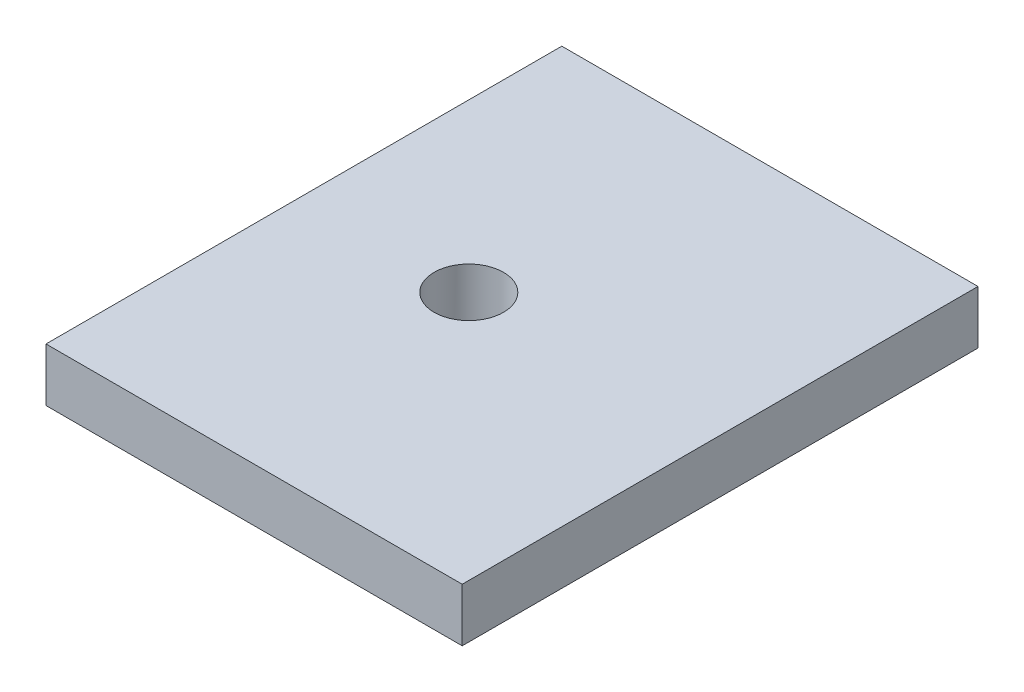
ISO-10303-21;
HEADER;
FILE_DESCRIPTION(('STEP AP214'),'2;1');
FILE_NAME('part.step','',(''),(''),'','','');
FILE_SCHEMA(('AUTOMOTIVE_DESIGN { 1 0 10303 214 1 1 1 1 }'));
ENDSEC;
DATA;
#1=APPLICATION_CONTEXT('core data for automotive mechanical design processes');
#2=APPLICATION_PROTOCOL_DEFINITION('international standard','automotive_design',2000,#1);
#3=PRODUCT_CONTEXT('',#1,'mechanical');
#4=PRODUCT('Part','Part','',(#3));
#5=PRODUCT_RELATED_PRODUCT_CATEGORY('part','',(#4));
#6=PRODUCT_DEFINITION_FORMATION('','',#4);
#7=PRODUCT_DEFINITION_CONTEXT('part definition',#1,'design');
#8=PRODUCT_DEFINITION('design','',#6,#7);
#9=PRODUCT_DEFINITION_SHAPE('','',#8);
#10=(LENGTH_UNIT() NAMED_UNIT(*) SI_UNIT(.MILLI.,.METRE.));
#11=(NAMED_UNIT(*) PLANE_ANGLE_UNIT() SI_UNIT($,.RADIAN.));
#12=(NAMED_UNIT(*) SI_UNIT($,.STERADIAN.) SOLID_ANGLE_UNIT());
#13=UNCERTAINTY_MEASURE_WITH_UNIT(LENGTH_MEASURE(1.E-05),#10,'distance_accuracy_value','');
#14=(GEOMETRIC_REPRESENTATION_CONTEXT(3) GLOBAL_UNCERTAINTY_ASSIGNED_CONTEXT((#13)) GLOBAL_UNIT_ASSIGNED_CONTEXT((#10,
#11,#12)) REPRESENTATION_CONTEXT('',''));
#15=CARTESIAN_POINT('',(0.,0.,0.));
#16=DIRECTION('',(0.,0.,1.));
#17=DIRECTION('',(1.,0.,0.));
#18=AXIS2_PLACEMENT_3D('',#15,#16,#17);
#19=CARTESIAN_POINT('',(0.,3.,0.));
#20=DIRECTION('',(0.,-1.,0.));
#21=DIRECTION('',(0.,0.,-1.));
#22=AXIS2_PLACEMENT_3D('',#19,#20,#21);
#23=PLANE('',#22);
#24=CARTESIAN_POINT('',(-2.32817741662061,3.,0.100000000001585));
#25=DIRECTION('',(0.,1.,0.));
#26=DIRECTION('',(0.,0.,1.));
#27=AXIS2_PLACEMENT_3D('',#24,#25,#26);
#28=CIRCLE('',#27,1.95000000000004);
#29=CARTESIAN_POINT('',(-2.32817741662061,3.,2.05000000000162));
#30=VERTEX_POINT('',#29);
#31=EDGE_CURVE('E111',#30,#30,#28,.T.);
#32=ORIENTED_EDGE('',*,*,#31,.F.);
#33=EDGE_LOOP('',(#32));
#34=FACE_BOUND('',#33,.T.);
#35=DIRECTION('',(0.,0.,-1.));
#36=VECTOR('',#35,1.);
#37=CARTESIAN_POINT('',(11.7,3.,14.5));
#38=LINE('',#37,#36);
#39=CARTESIAN_POINT('',(11.7,3.,14.5));
#40=VERTEX_POINT('',#39);
#41=CARTESIAN_POINT('',(11.7,3.,-14.5));
#42=VERTEX_POINT('',#41);
#43=EDGE_CURVE('E85',#40,#42,#38,.T.);
#44=ORIENTED_EDGE('',*,*,#43,.T.);
#45=DIRECTION('',(-1.,0.,0.));
#46=VECTOR('',#45,1.);
#47=CARTESIAN_POINT('',(-11.7,3.,-14.5));
#48=LINE('',#47,#46);
#49=CARTESIAN_POINT('',(-11.7,3.,-14.5));
#50=VERTEX_POINT('',#49);
#51=EDGE_CURVE('E81',#42,#50,#48,.T.);
#52=ORIENTED_EDGE('',*,*,#51,.T.);
#53=DIRECTION('',(0.,0.,1.));
#54=VECTOR('',#53,1.);
#55=CARTESIAN_POINT('',(-11.7,3.,14.5));
#56=LINE('',#55,#54);
#57=CARTESIAN_POINT('',(-11.7,3.,14.5));
#58=VERTEX_POINT('',#57);
#59=EDGE_CURVE('E83',#50,#58,#56,.T.);
#60=ORIENTED_EDGE('',*,*,#59,.T.);
#61=DIRECTION('',(1.,0.,0.));
#62=VECTOR('',#61,1.);
#63=CARTESIAN_POINT('',(-11.7,3.,14.5));
#64=LINE('',#63,#62);
#65=EDGE_CURVE('E51',#58,#40,#64,.T.);
#66=ORIENTED_EDGE('',*,*,#65,.T.);
#67=EDGE_LOOP('',(#44,#52,#60,#66));
#68=FACE_BOUND('',#67,.T.);
#69=ADVANCED_FACE('F33',(#34,#68),#23,.F.);
#70=CARTESIAN_POINT('',(0.,0.,0.));
#71=DIRECTION('',(0.,-1.,0.));
#72=DIRECTION('',(0.,0.,-1.));
#73=AXIS2_PLACEMENT_3D('',#70,#71,#72);
#74=PLANE('',#73);
#75=CARTESIAN_POINT('',(-2.32817741662061,0.,0.100000000001585));
#76=DIRECTION('',(0.,-1.,0.));
#77=DIRECTION('',(0.,0.,-1.));
#78=AXIS2_PLACEMENT_3D('',#75,#76,#77);
#79=CIRCLE('',#78,1.95000000000004);
#80=CARTESIAN_POINT('',(-2.32817741662061,0.,-1.84999999999845));
#81=VERTEX_POINT('',#80);
#82=EDGE_CURVE('E37',#81,#81,#79,.T.);
#83=ORIENTED_EDGE('',*,*,#82,.F.);
#84=EDGE_LOOP('',(#83));
#85=FACE_BOUND('',#84,.T.);
#86=DIRECTION('',(0.,0.,-1.));
#87=VECTOR('',#86,1.);
#88=CARTESIAN_POINT('',(11.7,0.,14.5));
#89=LINE('',#88,#87);
#90=CARTESIAN_POINT('',(11.7,0.,14.5));
#91=VERTEX_POINT('',#90);
#92=CARTESIAN_POINT('',(11.7,0.,-14.5));
#93=VERTEX_POINT('',#92);
#94=EDGE_CURVE('E98',#91,#93,#89,.T.);
#95=ORIENTED_EDGE('',*,*,#94,.F.);
#96=DIRECTION('',(1.,0.,0.));
#97=VECTOR('',#96,1.);
#98=CARTESIAN_POINT('',(-11.7,0.,14.5));
#99=LINE('',#98,#97);
#100=CARTESIAN_POINT('',(-11.7,0.,14.5));
#101=VERTEX_POINT('',#100);
#102=EDGE_CURVE('E74',#101,#91,#99,.T.);
#103=ORIENTED_EDGE('',*,*,#102,.F.);
#104=DIRECTION('',(0.,0.,1.));
#105=VECTOR('',#104,1.);
#106=CARTESIAN_POINT('',(-11.7,0.,14.5));
#107=LINE('',#106,#105);
#108=CARTESIAN_POINT('',(-11.7,0.,-14.5));
#109=VERTEX_POINT('',#108);
#110=EDGE_CURVE('E68',#109,#101,#107,.T.);
#111=ORIENTED_EDGE('',*,*,#110,.F.);
#112=DIRECTION('',(-1.,0.,0.));
#113=VECTOR('',#112,1.);
#114=CARTESIAN_POINT('',(-11.7,0.,-14.5));
#115=LINE('',#114,#113);
#116=EDGE_CURVE('E89',#93,#109,#115,.T.);
#117=ORIENTED_EDGE('',*,*,#116,.F.);
#118=EDGE_LOOP('',(#95,#103,#111,#117));
#119=FACE_BOUND('',#118,.T.);
#120=ADVANCED_FACE('F108',(#85,#119),#74,.T.);
#121=CARTESIAN_POINT('',(11.7,3.,14.5));
#122=DIRECTION('',(-1.,0.,0.));
#123=DIRECTION('',(0.,0.,1.));
#124=AXIS2_PLACEMENT_3D('',#121,#122,#123);
#125=PLANE('',#124);
#126=ORIENTED_EDGE('',*,*,#94,.T.);
#127=DIRECTION('',(0.,-1.,0.));
#128=VECTOR('',#127,1.);
#129=CARTESIAN_POINT('',(11.7,3.,-14.5));
#130=LINE('',#129,#128);
#131=EDGE_CURVE('E11',#42,#93,#130,.T.);
#132=ORIENTED_EDGE('',*,*,#131,.F.);
#133=ORIENTED_EDGE('',*,*,#43,.F.);
#134=DIRECTION('',(0.,-1.,0.));
#135=VECTOR('',#134,1.);
#136=CARTESIAN_POINT('',(11.7,3.,14.5));
#137=LINE('',#136,#135);
#138=EDGE_CURVE('E94',#40,#91,#137,.T.);
#139=ORIENTED_EDGE('',*,*,#138,.T.);
#140=EDGE_LOOP('',(#126,#132,#133,#139));
#141=FACE_BOUND('',#140,.T.);
#142=ADVANCED_FACE('F35',(#141),#125,.F.);
#143=CARTESIAN_POINT('',(-11.7,3.,-14.5));
#144=DIRECTION('',(0.,0.,1.));
#145=DIRECTION('',(1.,0.,0.));
#146=AXIS2_PLACEMENT_3D('',#143,#144,#145);
#147=PLANE('',#146);
#148=ORIENTED_EDGE('',*,*,#116,.T.);
#149=DIRECTION('',(0.,-1.,0.));
#150=VECTOR('',#149,1.);
#151=CARTESIAN_POINT('',(-11.7,3.,-14.5));
#152=LINE('',#151,#150);
#153=EDGE_CURVE('E43',#50,#109,#152,.T.);
#154=ORIENTED_EDGE('',*,*,#153,.F.);
#155=ORIENTED_EDGE('',*,*,#51,.F.);
#156=ORIENTED_EDGE('',*,*,#131,.T.);
#157=EDGE_LOOP('',(#148,#154,#155,#156));
#158=FACE_BOUND('',#157,.T.);
#159=ADVANCED_FACE('F88',(#158),#147,.F.);
#160=CARTESIAN_POINT('',(-11.7,3.,14.5));
#161=DIRECTION('',(1.,0.,0.));
#162=DIRECTION('',(0.,0.,-1.));
#163=AXIS2_PLACEMENT_3D('',#160,#161,#162);
#164=PLANE('',#163);
#165=ORIENTED_EDGE('',*,*,#110,.T.);
#166=DIRECTION('',(0.,-1.,0.));
#167=VECTOR('',#166,1.);
#168=CARTESIAN_POINT('',(-11.7,3.,14.5));
#169=LINE('',#168,#167);
#170=EDGE_CURVE('E90',#58,#101,#169,.T.);
#171=ORIENTED_EDGE('',*,*,#170,.F.);
#172=ORIENTED_EDGE('',*,*,#59,.F.);
#173=ORIENTED_EDGE('',*,*,#153,.T.);
#174=EDGE_LOOP('',(#165,#171,#172,#173));
#175=FACE_BOUND('',#174,.T.);
#176=ADVANCED_FACE('F92',(#175),#164,.F.);
#177=CARTESIAN_POINT('',(-11.7,3.,14.5));
#178=DIRECTION('',(0.,0.,-1.));
#179=DIRECTION('',(-1.,0.,0.));
#180=AXIS2_PLACEMENT_3D('',#177,#178,#179);
#181=PLANE('',#180);
#182=ORIENTED_EDGE('',*,*,#102,.T.);
#183=ORIENTED_EDGE('',*,*,#138,.F.);
#184=ORIENTED_EDGE('',*,*,#65,.F.);
#185=ORIENTED_EDGE('',*,*,#170,.T.);
#186=EDGE_LOOP('',(#182,#183,#184,#185));
#187=FACE_BOUND('',#186,.T.);
#188=ADVANCED_FACE('F105',(#187),#181,.F.);
#189=CARTESIAN_POINT('',(-2.32817741662061,-7.,0.100000000001585));
#190=DIRECTION('',(0.,1.,0.));
#191=DIRECTION('',(0.,0.,1.));
#192=AXIS2_PLACEMENT_3D('',#189,#190,#191);
#193=CYLINDRICAL_SURFACE('',#192,1.95000000000004);
#194=ORIENTED_EDGE('',*,*,#82,.T.);
#195=EDGE_LOOP('',(#194));
#196=FACE_BOUND('',#195,.T.);
#197=ORIENTED_EDGE('',*,*,#31,.T.);
#198=EDGE_LOOP('',(#197));
#199=FACE_BOUND('',#198,.T.);
#200=ADVANCED_FACE('F118',(#196,#199),#193,.F.);
#201=CLOSED_SHELL('',(#69,#120,#142,#159,#176,#188,#200));
#202=MANIFOLD_SOLID_BREP('B2',#201);
#203=ADVANCED_BREP_SHAPE_REPRESENTATION('',(#18,#202),#14);
#204=SHAPE_DEFINITION_REPRESENTATION(#9,#203);
ENDSEC;
END-ISO-10303-21;
